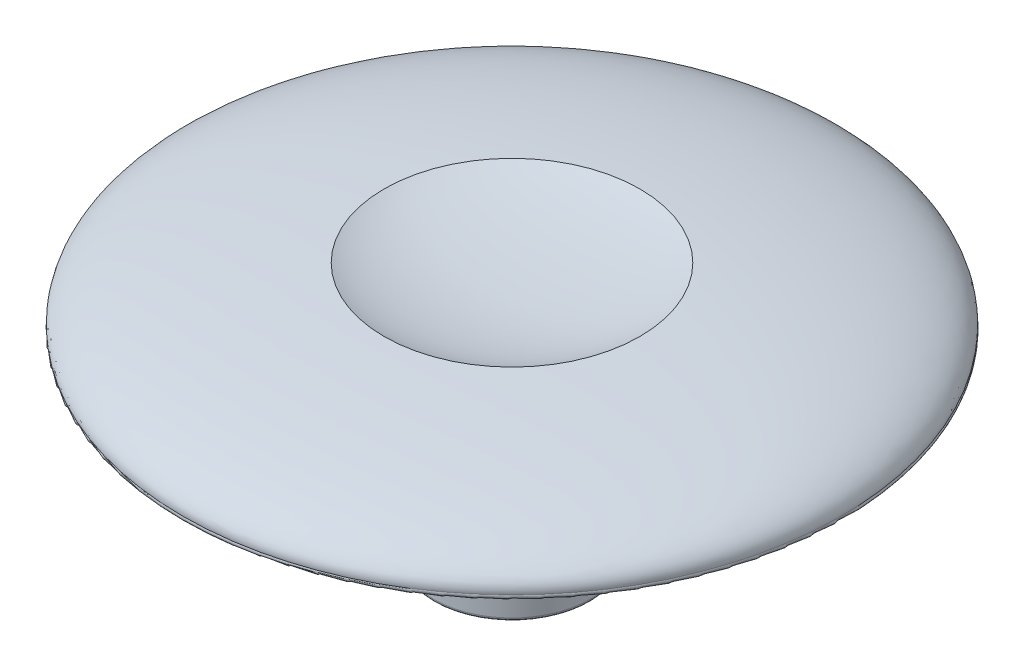
ISO-10303-21;
HEADER;
FILE_DESCRIPTION(('STEP AP214'),'2;1');
FILE_NAME('part.step','',(''),(''),'','','');
FILE_SCHEMA(('AUTOMOTIVE_DESIGN { 1 0 10303 214 1 1 1 1 }'));
ENDSEC;
DATA;
#1=APPLICATION_CONTEXT('core data for automotive mechanical design processes');
#2=APPLICATION_PROTOCOL_DEFINITION('international standard','automotive_design',2000,#1);
#3=PRODUCT_CONTEXT('',#1,'mechanical');
#4=PRODUCT('Part','Part','',(#3));
#5=PRODUCT_RELATED_PRODUCT_CATEGORY('part','',(#4));
#6=PRODUCT_DEFINITION_FORMATION('','',#4);
#7=PRODUCT_DEFINITION_CONTEXT('part definition',#1,'design');
#8=PRODUCT_DEFINITION('design','',#6,#7);
#9=PRODUCT_DEFINITION_SHAPE('','',#8);
#10=(LENGTH_UNIT() NAMED_UNIT(*) SI_UNIT(.MILLI.,.METRE.));
#11=(NAMED_UNIT(*) PLANE_ANGLE_UNIT() SI_UNIT($,.RADIAN.));
#12=(NAMED_UNIT(*) SI_UNIT($,.STERADIAN.) SOLID_ANGLE_UNIT());
#13=UNCERTAINTY_MEASURE_WITH_UNIT(LENGTH_MEASURE(1.E-05),#10,'distance_accuracy_value','');
#14=(GEOMETRIC_REPRESENTATION_CONTEXT(3) GLOBAL_UNCERTAINTY_ASSIGNED_CONTEXT((#13)) GLOBAL_UNIT_ASSIGNED_CONTEXT((#10,
#11,#12)) REPRESENTATION_CONTEXT('',''));
#15=CARTESIAN_POINT('',(0.,0.,0.));
#16=DIRECTION('',(0.,0.,1.));
#17=DIRECTION('',(1.,0.,0.));
#18=AXIS2_PLACEMENT_3D('',#15,#16,#17);
#19=CARTESIAN_POINT('',(0.,0.,0.));
#20=DIRECTION('',(0.,1.,0.));
#21=DIRECTION('',(0.,0.,1.));
#22=AXIS2_PLACEMENT_3D('',#19,#20,#21);
#23=PLANE('',#22);
#24=CARTESIAN_POINT('',(0.,0.,0.));
#25=DIRECTION('',(0.,1.,0.));
#26=DIRECTION('',(0.,0.,1.));
#27=AXIS2_PLACEMENT_3D('',#24,#25,#26);
#28=CIRCLE('',#27,0.7);
#29=CARTESIAN_POINT('',(0.,0.,0.7));
#30=VERTEX_POINT('',#29);
#31=EDGE_CURVE('E11',#30,#30,#28,.T.);
#32=ORIENTED_EDGE('',*,*,#31,.F.);
#33=EDGE_LOOP('',(#32));
#34=FACE_BOUND('',#33,.T.);
#35=ADVANCED_FACE('F34',(#34),#23,.F.);
#36=CARTESIAN_POINT('',(0.,0.628352907356071,0.));
#37=DIRECTION('',(0.,1.,0.));
#38=DIRECTION('',(0.,0.,1.));
#39=AXIS2_PLACEMENT_3D('',#36,#37,#38);
#40=CYLINDRICAL_SURFACE('',#39,0.700000000000003);
#41=CARTESIAN_POINT('',(0.,-2.95,0.));
#42=DIRECTION('',(0.,1.,0.));
#43=DIRECTION('',(0.,0.,1.));
#44=AXIS2_PLACEMENT_3D('',#41,#42,#43);
#45=CIRCLE('',#44,0.700000000000005);
#46=CARTESIAN_POINT('',(0.,-2.95,0.70000000000001));
#47=VERTEX_POINT('',#46);
#48=EDGE_CURVE('E40',#47,#47,#45,.T.);
#49=ORIENTED_EDGE('',*,*,#48,.F.);
#50=EDGE_LOOP('',(#49));
#51=FACE_BOUND('',#50,.T.);
#52=ORIENTED_EDGE('',*,*,#31,.T.);
#53=EDGE_LOOP('',(#52));
#54=FACE_BOUND('',#53,.T.);
#55=ADVANCED_FACE('F85',(#51,#54),#40,.F.);
#56=CARTESIAN_POINT('',(0.,-2.95,0.));
#57=DIRECTION('',(0.,1.,0.));
#58=DIRECTION('',(0.,0.,1.));
#59=AXIS2_PLACEMENT_3D('',#56,#57,#58);
#60=TOROIDAL_SURFACE('',#59,0.750000000000005,0.0500000000000001);
#61=CARTESIAN_POINT('',(0.,-3.,0.));
#62=DIRECTION('',(0.,1.,0.));
#63=DIRECTION('',(0.,0.,1.));
#64=AXIS2_PLACEMENT_3D('',#61,#62,#63);
#65=CIRCLE('',#64,0.750000000000005);
#66=CARTESIAN_POINT('',(0.,-3.,0.75000000000001));
#67=VERTEX_POINT('',#66);
#68=EDGE_CURVE('E78',#67,#67,#65,.T.);
#69=ORIENTED_EDGE('',*,*,#68,.F.);
#70=EDGE_LOOP('',(#69));
#71=FACE_BOUND('',#70,.T.);
#72=ORIENTED_EDGE('',*,*,#48,.T.);
#73=EDGE_LOOP('',(#72));
#74=FACE_BOUND('',#73,.T.);
#75=ADVANCED_FACE('F83',(#71,#74),#60,.T.);
#76=CARTESIAN_POINT('',(0.,-3.,-1.15));
#77=DIRECTION('',(0.,1.,0.));
#78=DIRECTION('',(0.,0.,1.));
#79=AXIS2_PLACEMENT_3D('',#76,#77,#78);
#80=PLANE('',#79);
#81=CARTESIAN_POINT('',(0.,-3.,0.));
#82=DIRECTION('',(0.,1.,0.));
#83=DIRECTION('',(0.,0.,1.));
#84=AXIS2_PLACEMENT_3D('',#81,#82,#83);
#85=CIRCLE('',#84,1.15000000000001);
#86=CARTESIAN_POINT('',(0.,-3.,1.15000000000001));
#87=VERTEX_POINT('',#86);
#88=EDGE_CURVE('E75',#87,#87,#85,.T.);
#89=ORIENTED_EDGE('',*,*,#88,.F.);
#90=EDGE_LOOP('',(#89));
#91=FACE_BOUND('',#90,.T.);
#92=ORIENTED_EDGE('',*,*,#68,.T.);
#93=EDGE_LOOP('',(#92));
#94=FACE_BOUND('',#93,.T.);
#95=ADVANCED_FACE('F103',(#91,#94),#80,.F.);
#96=CARTESIAN_POINT('',(0.,-2.95,0.));
#97=DIRECTION('',(0.,1.,0.));
#98=DIRECTION('',(0.,0.,1.));
#99=AXIS2_PLACEMENT_3D('',#96,#97,#98);
#100=TOROIDAL_SURFACE('',#99,1.15000000000001,0.0499999999999999);
#101=CARTESIAN_POINT('',(0.,-2.95,0.));
#102=DIRECTION('',(0.,1.,0.));
#103=DIRECTION('',(0.,0.,1.));
#104=AXIS2_PLACEMENT_3D('',#101,#102,#103);
#105=CIRCLE('',#104,1.20000000000001);
#106=CARTESIAN_POINT('',(0.,-2.95,1.20000000000001));
#107=VERTEX_POINT('',#106);
#108=EDGE_CURVE('E72',#107,#107,#105,.T.);
#109=ORIENTED_EDGE('',*,*,#108,.F.);
#110=EDGE_LOOP('',(#109));
#111=FACE_BOUND('',#110,.T.);
#112=ORIENTED_EDGE('',*,*,#88,.T.);
#113=EDGE_LOOP('',(#112));
#114=FACE_BOUND('',#113,.T.);
#115=ADVANCED_FACE('F111',(#111,#114),#100,.T.);
#116=CARTESIAN_POINT('',(0.,0.628352907356071,0.));
#117=DIRECTION('',(0.,1.,0.));
#118=DIRECTION('',(0.,0.,1.));
#119=AXIS2_PLACEMENT_3D('',#116,#117,#118);
#120=CYLINDRICAL_SURFACE('',#119,1.2);
#121=CARTESIAN_POINT('',(0.,-0.0999999999999978,0.));
#122=DIRECTION('',(0.,1.,0.));
#123=DIRECTION('',(0.,0.,1.));
#124=AXIS2_PLACEMENT_3D('',#121,#122,#123);
#125=CIRCLE('',#124,1.2);
#126=CARTESIAN_POINT('',(0.,-0.0999999999999957,1.2));
#127=VERTEX_POINT('',#126);
#128=EDGE_CURVE('E69',#127,#127,#125,.T.);
#129=ORIENTED_EDGE('',*,*,#128,.F.);
#130=EDGE_LOOP('',(#129));
#131=FACE_BOUND('',#130,.T.);
#132=ORIENTED_EDGE('',*,*,#108,.T.);
#133=EDGE_LOOP('',(#132));
#134=FACE_BOUND('',#133,.T.);
#135=ADVANCED_FACE('F119',(#131,#134),#120,.T.);
#136=CARTESIAN_POINT('',(0.,-0.0999999999999992,-1.2));
#137=DIRECTION('',(0.,1.,0.));
#138=DIRECTION('',(0.,0.,1.));
#139=AXIS2_PLACEMENT_3D('',#136,#137,#138);
#140=PLANE('',#139);
#141=CARTESIAN_POINT('',(0.,-0.0999999999999965,0.));
#142=DIRECTION('',(0.,1.,0.));
#143=DIRECTION('',(0.,0.,1.));
#144=AXIS2_PLACEMENT_3D('',#141,#142,#143);
#145=CIRCLE('',#144,2.);
#146=CARTESIAN_POINT('',(0.,-0.0999999999999931,2.));
#147=VERTEX_POINT('',#146);
#148=EDGE_CURVE('E66',#147,#147,#145,.T.);
#149=ORIENTED_EDGE('',*,*,#148,.F.);
#150=EDGE_LOOP('',(#149));
#151=FACE_BOUND('',#150,.T.);
#152=ORIENTED_EDGE('',*,*,#128,.T.);
#153=EDGE_LOOP('',(#152));
#154=FACE_BOUND('',#153,.T.);
#155=ADVANCED_FACE('F127',(#151,#154),#140,.F.);
#156=CARTESIAN_POINT('',(0.,0.628352907356071,0.));
#157=DIRECTION('',(0.,1.,0.));
#158=DIRECTION('',(0.,0.,1.));
#159=AXIS2_PLACEMENT_3D('',#156,#157,#158);
#160=CYLINDRICAL_SURFACE('',#159,2.);
#161=CARTESIAN_POINT('',(0.,0.,0.));
#162=DIRECTION('',(0.,1.,0.));
#163=DIRECTION('',(0.,0.,1.));
#164=AXIS2_PLACEMENT_3D('',#161,#162,#163);
#165=CIRCLE('',#164,2.);
#166=CARTESIAN_POINT('',(0.,0.,2.));
#167=VERTEX_POINT('',#166);
#168=EDGE_CURVE('E63',#167,#167,#165,.T.);
#169=ORIENTED_EDGE('',*,*,#168,.F.);
#170=EDGE_LOOP('',(#169));
#171=FACE_BOUND('',#170,.T.);
#172=ORIENTED_EDGE('',*,*,#148,.T.);
#173=EDGE_LOOP('',(#172));
#174=FACE_BOUND('',#173,.T.);
#175=ADVANCED_FACE('F135',(#171,#174),#160,.T.);
#176=CARTESIAN_POINT('',(0.,0.,-2.));
#177=DIRECTION('',(0.,1.,0.));
#178=DIRECTION('',(0.,0.,1.));
#179=AXIS2_PLACEMENT_3D('',#176,#177,#178);
#180=PLANE('',#179);
#181=CARTESIAN_POINT('',(0.,0.,0.));
#182=DIRECTION('',(0.,1.,0.));
#183=DIRECTION('',(0.,0.,1.));
#184=AXIS2_PLACEMENT_3D('',#181,#182,#183);
#185=CIRCLE('',#184,5.);
#186=CARTESIAN_POINT('',(0.,0.,5.));
#187=VERTEX_POINT('',#186);
#188=EDGE_CURVE('E55',#187,#187,#185,.T.);
#189=ORIENTED_EDGE('',*,*,#188,.F.);
#190=EDGE_LOOP('',(#189));
#191=FACE_BOUND('',#190,.T.);
#192=ORIENTED_EDGE('',*,*,#168,.T.);
#193=EDGE_LOOP('',(#192));
#194=FACE_BOUND('',#193,.T.);
#195=ADVANCED_FACE('F143',(#191,#194),#180,.F.);
#196=CARTESIAN_POINT('',(0.,0.0500000000000086,0.));
#197=DIRECTION('',(0.,1.,0.));
#198=DIRECTION('',(0.,0.,1.));
#199=AXIS2_PLACEMENT_3D('',#196,#197,#198);
#200=TOROIDAL_SURFACE('',#199,5.,0.0499999999999998);
#201=CARTESIAN_POINT('',(0.,0.0735174867661617,0.));
#202=DIRECTION('',(0.,1.,0.));
#203=DIRECTION('',(0.,0.,1.));
#204=AXIS2_PLACEMENT_3D('',#201,#202,#203);
#205=CIRCLE('',#204,5.04412400498826);
#206=CARTESIAN_POINT('',(0.,0.0735174867661703,5.04412400498826));
#207=VERTEX_POINT('',#206);
#208=EDGE_CURVE('E52',#207,#207,#205,.T.);
#209=ORIENTED_EDGE('',*,*,#208,.F.);
#210=EDGE_LOOP('',(#209));
#211=FACE_BOUND('',#210,.T.);
#212=ORIENTED_EDGE('',*,*,#188,.T.);
#213=EDGE_LOOP('',(#212));
#214=FACE_BOUND('',#213,.T.);
#215=ADVANCED_FACE('F151',(#211,#214),#200,.T.);
#216=CARTESIAN_POINT('',(0.,0.,0.));
#217=DIRECTION('',(1.,0.,0.));
#218=DIRECTION('',(0.,0.0210960131339077,-0.999777454351644));
#219=AXIS2_PLACEMENT_3D('',#216,#217,#218);
#220=ELLIPSE('',#219,5.04757155576345,0.951638930515451);
#221=TRIMMED_CURVE('',#220,(PARAMETER_VALUE(4.70841079998664)),
(PARAMETER_VALUE(7.85000345357643)),.T.,.PARAMETER.);
#222=CARTESIAN_POINT('',(0.,0.628352907356071,0.));
#223=DIRECTION('',(0.,1.,0.));
#224=AXIS1_PLACEMENT('',#222,#223);
#225=SURFACE_OF_REVOLUTION('',#221,#224);
#226=CARTESIAN_POINT('',(0.,0.917022896518431,0.));
#227=DIRECTION('',(0.,1.,0.));
#228=DIRECTION('',(0.,0.,1.));
#229=AXIS2_PLACEMENT_3D('',#226,#227,#228);
#230=CIRCLE('',#229,1.95971451187376);
#231=CARTESIAN_POINT('',(0.,0.917022896518435,1.95971451187376));
#232=VERTEX_POINT('',#231);
#233=EDGE_CURVE('E50',#232,#232,#230,.T.);
#234=ORIENTED_EDGE('',*,*,#233,.F.);
#235=EDGE_LOOP('',(#234));
#236=FACE_BOUND('',#235,.T.);
#237=ORIENTED_EDGE('',*,*,#208,.T.);
#238=EDGE_LOOP('',(#237));
#239=FACE_BOUND('',#238,.T.);
#240=ADVANCED_FACE('F46',(#236,#239),#225,.T.);
#241=CARTESIAN_POINT('',(0.,1.21108505212009,-0.0196135670639411));
#242=DIRECTION('',(-1.,0.,0.));
#243=DIRECTION('',(0.,0.,-1.));
#244=AXIS2_PLACEMENT_3D('',#241,#242,#243);
#245=ELLIPSE('',#244,2.24718058519053,0.582754342108151);
#246=TRIMMED_CURVE('',#245,(PARAMETER_VALUE(-1.57952451545339)),
(PARAMETER_VALUE(1.57952451545339)),.T.,.PARAMETER.);
#247=CARTESIAN_POINT('',(0.,0.628352907356071,0.));
#248=DIRECTION('',(0.,1.,0.));
#249=AXIS1_PLACEMENT('',#247,#248);
#250=SURFACE_OF_REVOLUTION('',#246,#249);
#251=CARTESIAN_POINT('',(0.,0.628352907356071,0.));
#252=VERTEX_POINT('',#251);
#253=VERTEX_LOOP('',#252);
#254=FACE_BOUND('',#253,.T.);
#255=ORIENTED_EDGE('',*,*,#233,.T.);
#256=EDGE_LOOP('',(#255));
#257=FACE_BOUND('',#256,.T.);
#258=ADVANCED_FACE('F43',(#254,#257),#250,.T.);
#259=CLOSED_SHELL('',(#35,#55,#75,#95,#115,#135,#155,#175,#195,#215,#240,#258));
#260=MANIFOLD_SOLID_BREP('B2',#259);
#261=ADVANCED_BREP_SHAPE_REPRESENTATION('',(#18,#260),#14);
#262=SHAPE_DEFINITION_REPRESENTATION(#9,#261);
ENDSEC;
END-ISO-10303-21;
